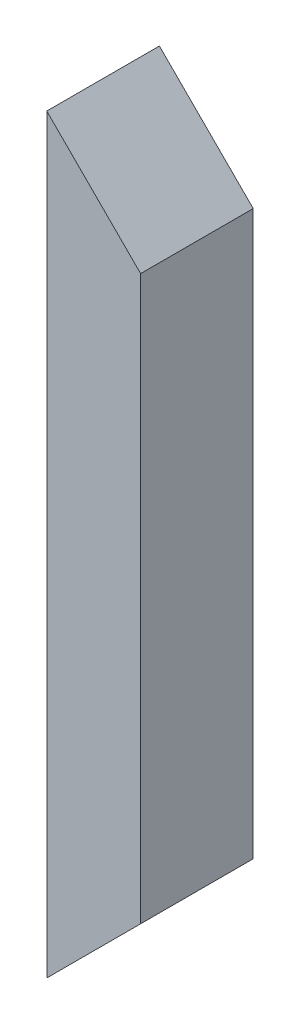
ISO-10303-21;
HEADER;
FILE_DESCRIPTION(('STEP AP214'),'2;1');
FILE_NAME('part.step','',(''),(''),'','','');
FILE_SCHEMA(('AUTOMOTIVE_DESIGN { 1 0 10303 214 1 1 1 1 }'));
ENDSEC;
DATA;
#1=APPLICATION_CONTEXT('core data for automotive mechanical design processes');
#2=APPLICATION_PROTOCOL_DEFINITION('international standard','automotive_design',2000,#1);
#3=PRODUCT_CONTEXT('',#1,'mechanical');
#4=PRODUCT('Part','Part','',(#3));
#5=PRODUCT_RELATED_PRODUCT_CATEGORY('part','',(#4));
#6=PRODUCT_DEFINITION_FORMATION('','',#4);
#7=PRODUCT_DEFINITION_CONTEXT('part definition',#1,'design');
#8=PRODUCT_DEFINITION('design','',#6,#7);
#9=PRODUCT_DEFINITION_SHAPE('','',#8);
#10=(LENGTH_UNIT() NAMED_UNIT(*) SI_UNIT(.MILLI.,.METRE.));
#11=(NAMED_UNIT(*) PLANE_ANGLE_UNIT() SI_UNIT($,.RADIAN.));
#12=(NAMED_UNIT(*) SI_UNIT($,.STERADIAN.) SOLID_ANGLE_UNIT());
#13=UNCERTAINTY_MEASURE_WITH_UNIT(LENGTH_MEASURE(1.E-05),#10,'distance_accuracy_value','');
#14=(GEOMETRIC_REPRESENTATION_CONTEXT(3) GLOBAL_UNCERTAINTY_ASSIGNED_CONTEXT((#13)) GLOBAL_UNIT_ASSIGNED_CONTEXT((#10,
#11,#12)) REPRESENTATION_CONTEXT('',''));
#15=CARTESIAN_POINT('',(0.,0.,0.));
#16=DIRECTION('',(0.,0.,1.));
#17=DIRECTION('',(1.,0.,0.));
#18=AXIS2_PLACEMENT_3D('',#15,#16,#17);
#19=CARTESIAN_POINT('',(0.,200.,0.));
#20=DIRECTION('',(1.,0.,0.));
#21=DIRECTION('',(0.,0.,-1.));
#22=AXIS2_PLACEMENT_3D('',#19,#20,#21);
#23=PLANE('',#22);
#24=DIRECTION('',(0.,0.,1.));
#25=VECTOR('',#24,1.);
#26=CARTESIAN_POINT('',(0.,0.,0.));
#27=LINE('',#26,#25);
#28=CARTESIAN_POINT('',(0.,0.,-30.));
#29=VERTEX_POINT('',#28);
#30=CARTESIAN_POINT('',(0.,0.,0.));
#31=VERTEX_POINT('',#30);
#32=EDGE_CURVE('E76',#29,#31,#27,.T.);
#33=ORIENTED_EDGE('',*,*,#32,.T.);
#34=DIRECTION('',(0.,-1.,0.));
#35=VECTOR('',#34,1.);
#36=CARTESIAN_POINT('',(0.,200.,0.));
#37=LINE('',#36,#35);
#38=CARTESIAN_POINT('',(0.,200.,0.));
#39=VERTEX_POINT('',#38);
#40=EDGE_CURVE('E11',#39,#31,#37,.T.);
#41=ORIENTED_EDGE('',*,*,#40,.F.);
#42=DIRECTION('',(0.,0.,1.));
#43=VECTOR('',#42,1.);
#44=CARTESIAN_POINT('',(0.,200.,0.));
#45=LINE('',#44,#43);
#46=CARTESIAN_POINT('',(0.,200.,-30.));
#47=VERTEX_POINT('',#46);
#48=EDGE_CURVE('E67',#47,#39,#45,.T.);
#49=ORIENTED_EDGE('',*,*,#48,.F.);
#50=DIRECTION('',(0.,-1.,0.));
#51=VECTOR('',#50,1.);
#52=CARTESIAN_POINT('',(0.,200.,-30.));
#53=LINE('',#52,#51);
#54=EDGE_CURVE('E75',#47,#29,#53,.T.);
#55=ORIENTED_EDGE('',*,*,#54,.T.);
#56=EDGE_LOOP('',(#33,#41,#49,#55));
#57=FACE_BOUND('',#56,.T.);
#58=ADVANCED_FACE('F33',(#57),#23,.F.);
#59=CARTESIAN_POINT('',(0.,200.,0.));
#60=DIRECTION('',(0.,0.,-1.));
#61=DIRECTION('',(-1.,0.,0.));
#62=AXIS2_PLACEMENT_3D('',#59,#60,#61);
#63=PLANE('',#62);
#64=DIRECTION('',(0.,-1.,0.));
#65=VECTOR('',#64,1.);
#66=CARTESIAN_POINT('',(25.,200.,0.));
#67=LINE('',#66,#65);
#68=CARTESIAN_POINT('',(25.,175.,0.));
#69=VERTEX_POINT('',#68);
#70=CARTESIAN_POINT('',(25.,24.9999999999997,0.));
#71=VERTEX_POINT('',#70);
#72=EDGE_CURVE('E41',#69,#71,#67,.T.);
#73=ORIENTED_EDGE('',*,*,#72,.F.);
#74=DIRECTION('',(0.707106781186551,-0.707106781186544,0.));
#75=VECTOR('',#74,1.);
#76=CARTESIAN_POINT('',(25.,175.,0.));
#77=LINE('',#76,#75);
#78=EDGE_CURVE('E70',#39,#69,#77,.T.);
#79=ORIENTED_EDGE('',*,*,#78,.F.);
#80=ORIENTED_EDGE('',*,*,#40,.T.);
#81=DIRECTION('',(-0.707106781186551,-0.707106781186544,0.));
#82=VECTOR('',#81,1.);
#83=CARTESIAN_POINT('',(25.,24.9999999999997,0.));
#84=LINE('',#83,#82);
#85=EDGE_CURVE('E101',#71,#31,#84,.T.);
#86=ORIENTED_EDGE('',*,*,#85,.F.);
#87=EDGE_LOOP('',(#73,#79,#80,#86));
#88=FACE_BOUND('',#87,.T.);
#89=ADVANCED_FACE('F80',(#88),#63,.F.);
#90=CARTESIAN_POINT('',(25.,200.,0.));
#91=DIRECTION('',(-1.,0.,0.));
#92=DIRECTION('',(0.,0.,1.));
#93=AXIS2_PLACEMENT_3D('',#90,#91,#92);
#94=PLANE('',#93);
#95=DIRECTION('',(0.,-1.,0.));
#96=VECTOR('',#95,1.);
#97=CARTESIAN_POINT('',(25.,200.,-30.));
#98=LINE('',#97,#96);
#99=CARTESIAN_POINT('',(25.,175.,-30.));
#100=VERTEX_POINT('',#99);
#101=CARTESIAN_POINT('',(25.,24.9999999999997,-30.));
#102=VERTEX_POINT('',#101);
#103=EDGE_CURVE('E94',#100,#102,#98,.T.);
#104=ORIENTED_EDGE('',*,*,#103,.F.);
#105=DIRECTION('',(0.,0.,1.));
#106=VECTOR('',#105,1.);
#107=CARTESIAN_POINT('',(25.,175.,-200.));
#108=LINE('',#107,#106);
#109=EDGE_CURVE('E83',#100,#69,#108,.T.);
#110=ORIENTED_EDGE('',*,*,#109,.T.);
#111=ORIENTED_EDGE('',*,*,#72,.T.);
#112=DIRECTION('',(0.,0.,1.));
#113=VECTOR('',#112,1.);
#114=CARTESIAN_POINT('',(25.,24.9999999999997,-200.));
#115=LINE('',#114,#113);
#116=EDGE_CURVE('E90',#102,#71,#115,.T.);
#117=ORIENTED_EDGE('',*,*,#116,.F.);
#118=EDGE_LOOP('',(#104,#110,#111,#117));
#119=FACE_BOUND('',#118,.T.);
#120=ADVANCED_FACE('F99',(#119),#94,.F.);
#121=CARTESIAN_POINT('',(0.,200.,-30.));
#122=DIRECTION('',(0.,0.,1.));
#123=DIRECTION('',(1.,0.,0.));
#124=AXIS2_PLACEMENT_3D('',#121,#122,#123);
#125=PLANE('',#124);
#126=ORIENTED_EDGE('',*,*,#54,.F.);
#127=DIRECTION('',(0.707106781186551,-0.707106781186544,0.));
#128=VECTOR('',#127,1.);
#129=CARTESIAN_POINT('',(0.,200.,-30.));
#130=LINE('',#129,#128);
#131=EDGE_CURVE('E47',#47,#100,#130,.T.);
#132=ORIENTED_EDGE('',*,*,#131,.T.);
#133=ORIENTED_EDGE('',*,*,#103,.T.);
#134=DIRECTION('',(-0.707106781186551,-0.707106781186544,0.));
#135=VECTOR('',#134,1.);
#136=CARTESIAN_POINT('',(100.,99.9999999999989,-30.));
#137=LINE('',#136,#135);
#138=EDGE_CURVE('E88',#102,#29,#137,.T.);
#139=ORIENTED_EDGE('',*,*,#138,.T.);
#140=EDGE_LOOP('',(#126,#132,#133,#139));
#141=FACE_BOUND('',#140,.T.);
#142=ADVANCED_FACE('F107',(#141),#125,.F.);
#143=CARTESIAN_POINT('',(25.,24.9999999999997,-200.));
#144=DIRECTION('',(-0.707106781186544,0.707106781186551,0.));
#145=DIRECTION('',(-0.707106781186551,-0.707106781186544,0.));
#146=AXIS2_PLACEMENT_3D('',#143,#144,#145);
#147=PLANE('',#146);
#148=ORIENTED_EDGE('',*,*,#116,.T.);
#149=ORIENTED_EDGE('',*,*,#85,.T.);
#150=ORIENTED_EDGE('',*,*,#32,.F.);
#151=ORIENTED_EDGE('',*,*,#138,.F.);
#152=EDGE_LOOP('',(#148,#149,#150,#151));
#153=FACE_BOUND('',#152,.T.);
#154=ADVANCED_FACE('F100',(#153),#147,.F.);
#155=CARTESIAN_POINT('',(25.,175.,-200.));
#156=DIRECTION('',(-0.707106781186544,-0.707106781186551,0.));
#157=DIRECTION('',(0.707106781186551,-0.707106781186544,0.));
#158=AXIS2_PLACEMENT_3D('',#155,#156,#157);
#159=PLANE('',#158);
#160=ORIENTED_EDGE('',*,*,#48,.T.);
#161=ORIENTED_EDGE('',*,*,#78,.T.);
#162=ORIENTED_EDGE('',*,*,#109,.F.);
#163=ORIENTED_EDGE('',*,*,#131,.F.);
#164=EDGE_LOOP('',(#160,#161,#162,#163));
#165=FACE_BOUND('',#164,.T.);
#166=ADVANCED_FACE('F69',(#165),#159,.F.);
#167=CLOSED_SHELL('',(#58,#89,#120,#142,#154,#166));
#168=MANIFOLD_SOLID_BREP('B2',#167);
#169=ADVANCED_BREP_SHAPE_REPRESENTATION('',(#18,#168),#14);
#170=SHAPE_DEFINITION_REPRESENTATION(#9,#169);
ENDSEC;
END-ISO-10303-21;
